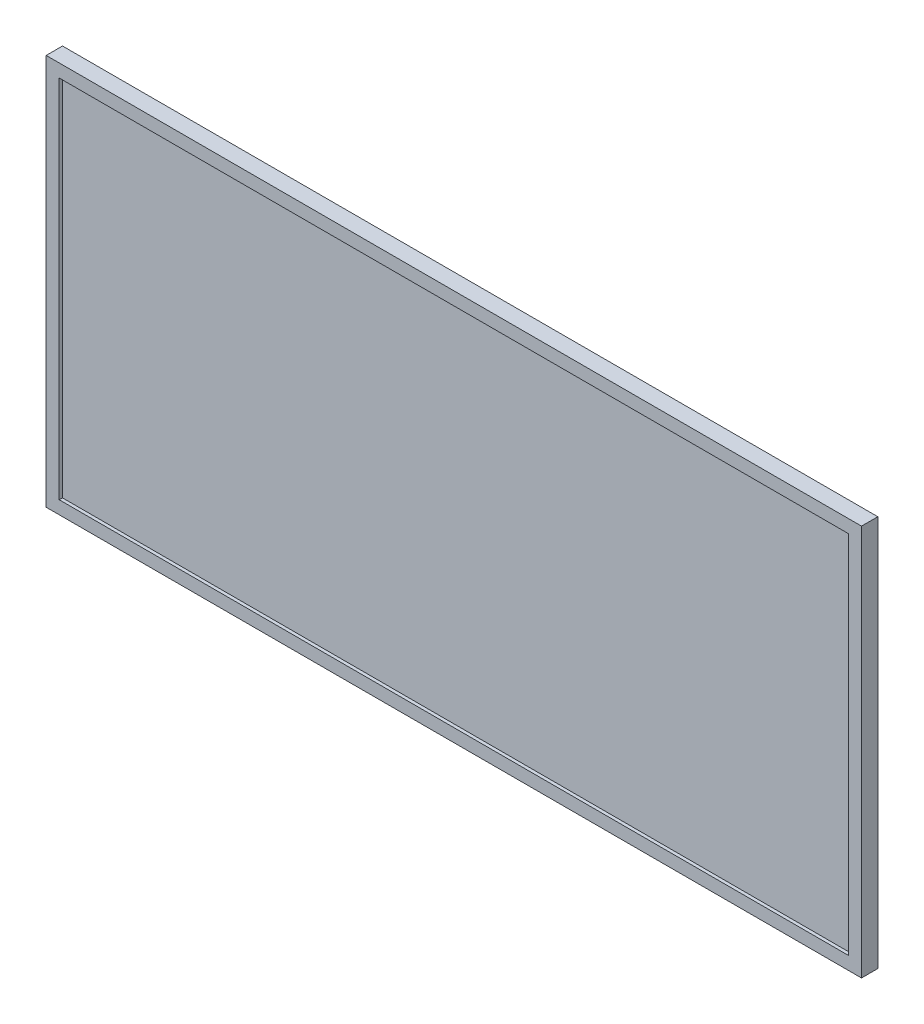
ISO-10303-21;
HEADER;
FILE_DESCRIPTION(('STEP AP214'),'2;1');
FILE_NAME('part.step','',(''),(''),'','','');
FILE_SCHEMA(('AUTOMOTIVE_DESIGN { 1 0 10303 214 1 1 1 1 }'));
ENDSEC;
DATA;
#1=APPLICATION_CONTEXT('core data for automotive mechanical design processes');
#2=APPLICATION_PROTOCOL_DEFINITION('international standard','automotive_design',2000,#1);
#3=PRODUCT_CONTEXT('',#1,'mechanical');
#4=PRODUCT('Part','Part','',(#3));
#5=PRODUCT_RELATED_PRODUCT_CATEGORY('part','',(#4));
#6=PRODUCT_DEFINITION_FORMATION('','',#4);
#7=PRODUCT_DEFINITION_CONTEXT('part definition',#1,'design');
#8=PRODUCT_DEFINITION('design','',#6,#7);
#9=PRODUCT_DEFINITION_SHAPE('','',#8);
#10=(LENGTH_UNIT() NAMED_UNIT(*) SI_UNIT(.MILLI.,.METRE.));
#11=(NAMED_UNIT(*) PLANE_ANGLE_UNIT() SI_UNIT($,.RADIAN.));
#12=(NAMED_UNIT(*) SI_UNIT($,.STERADIAN.) SOLID_ANGLE_UNIT());
#13=UNCERTAINTY_MEASURE_WITH_UNIT(LENGTH_MEASURE(1.E-05),#10,'distance_accuracy_value','');
#14=(GEOMETRIC_REPRESENTATION_CONTEXT(3) GLOBAL_UNCERTAINTY_ASSIGNED_CONTEXT((#13)) GLOBAL_UNIT_ASSIGNED_CONTEXT((#10,
#11,#12)) REPRESENTATION_CONTEXT('',''));
#15=CARTESIAN_POINT('',(0.,0.,0.));
#16=DIRECTION('',(0.,0.,1.));
#17=DIRECTION('',(1.,0.,0.));
#18=AXIS2_PLACEMENT_3D('',#15,#16,#17);
#19=CARTESIAN_POINT('',(0.,0.,0.));
#20=DIRECTION('',(0.,0.,-1.));
#21=DIRECTION('',(-1.,0.,0.));
#22=AXIS2_PLACEMENT_3D('',#19,#20,#21);
#23=PLANE('',#22);
#24=DIRECTION('',(0.,-1.,0.));
#25=VECTOR('',#24,1.);
#26=CARTESIAN_POINT('',(-250.,120.,0.));
#27=LINE('',#26,#25);
#28=CARTESIAN_POINT('',(-250.,120.,0.));
#29=VERTEX_POINT('',#28);
#30=CARTESIAN_POINT('',(-250.,-120.,0.));
#31=VERTEX_POINT('',#30);
#32=EDGE_CURVE('E186',#29,#31,#27,.T.);
#33=ORIENTED_EDGE('',*,*,#32,.F.);
#34=DIRECTION('',(-1.,0.,0.));
#35=VECTOR('',#34,1.);
#36=CARTESIAN_POINT('',(250.,120.,0.));
#37=LINE('',#36,#35);
#38=CARTESIAN_POINT('',(250.,120.,0.));
#39=VERTEX_POINT('',#38);
#40=EDGE_CURVE('E211',#39,#29,#37,.T.);
#41=ORIENTED_EDGE('',*,*,#40,.F.);
#42=DIRECTION('',(0.,1.,0.));
#43=VECTOR('',#42,1.);
#44=CARTESIAN_POINT('',(250.,120.,0.));
#45=LINE('',#44,#43);
#46=CARTESIAN_POINT('',(250.,-120.,0.));
#47=VERTEX_POINT('',#46);
#48=EDGE_CURVE('E222',#47,#39,#45,.T.);
#49=ORIENTED_EDGE('',*,*,#48,.F.);
#50=DIRECTION('',(1.,0.,0.));
#51=VECTOR('',#50,1.);
#52=CARTESIAN_POINT('',(250.,-120.,0.));
#53=LINE('',#52,#51);
#54=EDGE_CURVE('E220',#31,#47,#53,.T.);
#55=ORIENTED_EDGE('',*,*,#54,.F.);
#56=EDGE_LOOP('',(#33,#41,#49,#55));
#57=FACE_BOUND('',#56,.T.);
#58=DIRECTION('',(0.,1.,0.));
#59=VECTOR('',#58,1.);
#60=CARTESIAN_POINT('',(-40.,-30.,0.));
#61=LINE('',#60,#59);
#62=CARTESIAN_POINT('',(-40.,-30.,0.));
#63=VERTEX_POINT('',#62);
#64=CARTESIAN_POINT('',(-40.,30.,0.));
#65=VERTEX_POINT('',#64);
#66=EDGE_CURVE('E349',#63,#65,#61,.T.);
#67=ORIENTED_EDGE('',*,*,#66,.F.);
#68=CARTESIAN_POINT('',(-30.,-30.,0.));
#69=DIRECTION('',(0.,0.,-1.));
#70=DIRECTION('',(-1.,0.,0.));
#71=AXIS2_PLACEMENT_3D('',#68,#69,#70);
#72=CIRCLE('',#71,10.);
#73=CARTESIAN_POINT('',(-30.,-40.,0.));
#74=VERTEX_POINT('',#73);
#75=EDGE_CURVE('E172',#74,#63,#72,.T.);
#76=ORIENTED_EDGE('',*,*,#75,.F.);
#77=DIRECTION('',(-1.,0.,0.));
#78=VECTOR('',#77,1.);
#79=CARTESIAN_POINT('',(30.,-40.,0.));
#80=LINE('',#79,#78);
#81=CARTESIAN_POINT('',(30.,-40.,0.));
#82=VERTEX_POINT('',#81);
#83=EDGE_CURVE('E168',#82,#74,#80,.T.);
#84=ORIENTED_EDGE('',*,*,#83,.F.);
#85=CARTESIAN_POINT('',(30.,-30.,0.));
#86=DIRECTION('',(0.,0.,-1.));
#87=DIRECTION('',(1.,0.,0.));
#88=AXIS2_PLACEMENT_3D('',#85,#86,#87);
#89=CIRCLE('',#88,10.);
#90=CARTESIAN_POINT('',(40.,-30.,0.));
#91=VERTEX_POINT('',#90);
#92=EDGE_CURVE('E374',#91,#82,#89,.T.);
#93=ORIENTED_EDGE('',*,*,#92,.F.);
#94=DIRECTION('',(0.,-1.,0.));
#95=VECTOR('',#94,1.);
#96=CARTESIAN_POINT('',(40.,-30.,0.));
#97=LINE('',#96,#95);
#98=CARTESIAN_POINT('',(40.,30.,0.));
#99=VERTEX_POINT('',#98);
#100=EDGE_CURVE('E372',#99,#91,#97,.T.);
#101=ORIENTED_EDGE('',*,*,#100,.F.);
#102=CARTESIAN_POINT('',(30.,30.,0.));
#103=DIRECTION('',(0.,0.,-1.));
#104=DIRECTION('',(1.,0.,0.));
#105=AXIS2_PLACEMENT_3D('',#102,#103,#104);
#106=CIRCLE('',#105,10.);
#107=CARTESIAN_POINT('',(30.,40.,0.));
#108=VERTEX_POINT('',#107);
#109=EDGE_CURVE('E370',#108,#99,#106,.T.);
#110=ORIENTED_EDGE('',*,*,#109,.F.);
#111=DIRECTION('',(1.,0.,0.));
#112=VECTOR('',#111,1.);
#113=CARTESIAN_POINT('',(30.,40.,0.));
#114=LINE('',#113,#112);
#115=CARTESIAN_POINT('',(-30.,40.,0.));
#116=VERTEX_POINT('',#115);
#117=EDGE_CURVE('E368',#116,#108,#114,.T.);
#118=ORIENTED_EDGE('',*,*,#117,.F.);
#119=CARTESIAN_POINT('',(-30.,30.,0.));
#120=DIRECTION('',(0.,0.,-1.));
#121=DIRECTION('',(1.,0.,0.));
#122=AXIS2_PLACEMENT_3D('',#119,#120,#121);
#123=CIRCLE('',#122,10.);
#124=EDGE_CURVE('E366',#65,#116,#123,.T.);
#125=ORIENTED_EDGE('',*,*,#124,.F.);
#126=EDGE_LOOP('',(#67,#76,#84,#93,#101,#110,#118,#125));
#127=FACE_BOUND('',#126,.T.);
#128=ADVANCED_FACE('F35',(#57,#127),#23,.T.);
#129=CARTESIAN_POINT('',(0.,0.,10.));
#130=DIRECTION('',(0.,0.,-1.));
#131=DIRECTION('',(-1.,0.,0.));
#132=AXIS2_PLACEMENT_3D('',#129,#130,#131);
#133=PLANE('',#132);
#134=DIRECTION('',(0.,-1.,0.));
#135=VECTOR('',#134,1.);
#136=CARTESIAN_POINT('',(-250.,120.,10.));
#137=LINE('',#136,#135);
#138=CARTESIAN_POINT('',(-250.,120.,10.));
#139=VERTEX_POINT('',#138);
#140=CARTESIAN_POINT('',(-250.,-120.,10.));
#141=VERTEX_POINT('',#140);
#142=EDGE_CURVE('E207',#139,#141,#137,.T.);
#143=ORIENTED_EDGE('',*,*,#142,.T.);
#144=DIRECTION('',(1.,0.,0.));
#145=VECTOR('',#144,1.);
#146=CARTESIAN_POINT('',(250.,-120.,10.));
#147=LINE('',#146,#145);
#148=CARTESIAN_POINT('',(250.,-120.,10.));
#149=VERTEX_POINT('',#148);
#150=EDGE_CURVE('E210',#141,#149,#147,.T.);
#151=ORIENTED_EDGE('',*,*,#150,.T.);
#152=DIRECTION('',(0.,1.,0.));
#153=VECTOR('',#152,1.);
#154=CARTESIAN_POINT('',(250.,120.,10.));
#155=LINE('',#154,#153);
#156=CARTESIAN_POINT('',(250.,120.,10.));
#157=VERTEX_POINT('',#156);
#158=EDGE_CURVE('E213',#149,#157,#155,.T.);
#159=ORIENTED_EDGE('',*,*,#158,.T.);
#160=DIRECTION('',(-1.,0.,0.));
#161=VECTOR('',#160,1.);
#162=CARTESIAN_POINT('',(250.,120.,10.));
#163=LINE('',#162,#161);
#164=EDGE_CURVE('E215',#157,#139,#163,.T.);
#165=ORIENTED_EDGE('',*,*,#164,.T.);
#166=EDGE_LOOP('',(#143,#151,#159,#165));
#167=FACE_BOUND('',#166,.T.);
#168=DIRECTION('',(0.,-1.,0.));
#169=VECTOR('',#168,1.);
#170=CARTESIAN_POINT('',(-242.,0.,10.));
#171=LINE('',#170,#169);
#172=CARTESIAN_POINT('',(-242.,112.,10.));
#173=VERTEX_POINT('',#172);
#174=CARTESIAN_POINT('',(-242.,-112.,10.));
#175=VERTEX_POINT('',#174);
#176=EDGE_CURVE('E200',#173,#175,#171,.T.);
#177=ORIENTED_EDGE('',*,*,#176,.F.);
#178=DIRECTION('',(-1.,0.,0.));
#179=VECTOR('',#178,1.);
#180=CARTESIAN_POINT('',(0.,112.,10.));
#181=LINE('',#180,#179);
#182=CARTESIAN_POINT('',(242.,112.,10.));
#183=VERTEX_POINT('',#182);
#184=EDGE_CURVE('E191',#183,#173,#181,.T.);
#185=ORIENTED_EDGE('',*,*,#184,.F.);
#186=DIRECTION('',(0.,1.,0.));
#187=VECTOR('',#186,1.);
#188=CARTESIAN_POINT('',(242.,0.,10.));
#189=LINE('',#188,#187);
#190=CARTESIAN_POINT('',(242.,-112.,10.));
#191=VERTEX_POINT('',#190);
#192=EDGE_CURVE('E204',#191,#183,#189,.T.);
#193=ORIENTED_EDGE('',*,*,#192,.F.);
#194=DIRECTION('',(1.,0.,0.));
#195=VECTOR('',#194,1.);
#196=CARTESIAN_POINT('',(0.,-112.,10.));
#197=LINE('',#196,#195);
#198=EDGE_CURVE('E202',#175,#191,#197,.T.);
#199=ORIENTED_EDGE('',*,*,#198,.F.);
#200=EDGE_LOOP('',(#177,#185,#193,#199));
#201=FACE_BOUND('',#200,.T.);
#202=ADVANCED_FACE('F249',(#167,#201),#133,.F.);
#203=CARTESIAN_POINT('',(-250.,120.,10.));
#204=DIRECTION('',(1.,0.,0.));
#205=DIRECTION('',(0.,1.,0.));
#206=AXIS2_PLACEMENT_3D('',#203,#204,#205);
#207=PLANE('',#206);
#208=ORIENTED_EDGE('',*,*,#32,.T.);
#209=DIRECTION('',(0.,0.,-1.));
#210=VECTOR('',#209,1.);
#211=CARTESIAN_POINT('',(-250.,-120.,10.));
#212=LINE('',#211,#210);
#213=EDGE_CURVE('E11',#141,#31,#212,.T.);
#214=ORIENTED_EDGE('',*,*,#213,.F.);
#215=ORIENTED_EDGE('',*,*,#142,.F.);
#216=DIRECTION('',(0.,0.,-1.));
#217=VECTOR('',#216,1.);
#218=CARTESIAN_POINT('',(-250.,120.,10.));
#219=LINE('',#218,#217);
#220=EDGE_CURVE('E217',#139,#29,#219,.T.);
#221=ORIENTED_EDGE('',*,*,#220,.T.);
#222=EDGE_LOOP('',(#208,#214,#215,#221));
#223=FACE_BOUND('',#222,.T.);
#224=ADVANCED_FACE('F37',(#223),#207,.F.);
#225=CARTESIAN_POINT('',(250.,-120.,10.));
#226=DIRECTION('',(0.,1.,0.));
#227=DIRECTION('',(-1.,0.,0.));
#228=AXIS2_PLACEMENT_3D('',#225,#226,#227);
#229=PLANE('',#228);
#230=ORIENTED_EDGE('',*,*,#54,.T.);
#231=DIRECTION('',(0.,0.,-1.));
#232=VECTOR('',#231,1.);
#233=CARTESIAN_POINT('',(250.,-120.,10.));
#234=LINE('',#233,#232);
#235=EDGE_CURVE('E43',#149,#47,#234,.T.);
#236=ORIENTED_EDGE('',*,*,#235,.F.);
#237=ORIENTED_EDGE('',*,*,#150,.F.);
#238=ORIENTED_EDGE('',*,*,#213,.T.);
#239=EDGE_LOOP('',(#230,#236,#237,#238));
#240=FACE_BOUND('',#239,.T.);
#241=ADVANCED_FACE('F251',(#240),#229,.F.);
#242=CARTESIAN_POINT('',(250.,120.,10.));
#243=DIRECTION('',(-1.,0.,0.));
#244=DIRECTION('',(0.,-1.,0.));
#245=AXIS2_PLACEMENT_3D('',#242,#243,#244);
#246=PLANE('',#245);
#247=ORIENTED_EDGE('',*,*,#48,.T.);
#248=DIRECTION('',(0.,0.,-1.));
#249=VECTOR('',#248,1.);
#250=CARTESIAN_POINT('',(250.,120.,10.));
#251=LINE('',#250,#249);
#252=EDGE_CURVE('E227',#157,#39,#251,.T.);
#253=ORIENTED_EDGE('',*,*,#252,.F.);
#254=ORIENTED_EDGE('',*,*,#158,.F.);
#255=ORIENTED_EDGE('',*,*,#235,.T.);
#256=EDGE_LOOP('',(#247,#253,#254,#255));
#257=FACE_BOUND('',#256,.T.);
#258=ADVANCED_FACE('F234',(#257),#246,.F.);
#259=CARTESIAN_POINT('',(250.,120.,10.));
#260=DIRECTION('',(0.,-1.,0.));
#261=DIRECTION('',(1.,0.,0.));
#262=AXIS2_PLACEMENT_3D('',#259,#260,#261);
#263=PLANE('',#262);
#264=ORIENTED_EDGE('',*,*,#40,.T.);
#265=ORIENTED_EDGE('',*,*,#220,.F.);
#266=ORIENTED_EDGE('',*,*,#164,.F.);
#267=ORIENTED_EDGE('',*,*,#252,.T.);
#268=EDGE_LOOP('',(#264,#265,#266,#267));
#269=FACE_BOUND('',#268,.T.);
#270=ADVANCED_FACE('F243',(#269),#263,.F.);
#271=CARTESIAN_POINT('',(-242.,120.,10.));
#272=DIRECTION('',(1.,0.,0.));
#273=DIRECTION('',(0.,1.,0.));
#274=AXIS2_PLACEMENT_3D('',#271,#272,#273);
#275=PLANE('',#274);
#276=DIRECTION('',(0.,-1.,0.));
#277=VECTOR('',#276,1.);
#278=CARTESIAN_POINT('',(-242.,0.,8.));
#279=LINE('',#278,#277);
#280=CARTESIAN_POINT('',(-242.,112.,8.));
#281=VERTEX_POINT('',#280);
#282=CARTESIAN_POINT('',(-242.,-112.,8.));
#283=VERTEX_POINT('',#282);
#284=EDGE_CURVE('E174',#281,#283,#279,.T.);
#285=ORIENTED_EDGE('',*,*,#284,.F.);
#286=DIRECTION('',(0.,0.,-1.));
#287=VECTOR('',#286,1.);
#288=CARTESIAN_POINT('',(-242.,112.,10.));
#289=LINE('',#288,#287);
#290=EDGE_CURVE('E188',#173,#281,#289,.T.);
#291=ORIENTED_EDGE('',*,*,#290,.F.);
#292=ORIENTED_EDGE('',*,*,#176,.T.);
#293=DIRECTION('',(0.,0.,-1.));
#294=VECTOR('',#293,1.);
#295=CARTESIAN_POINT('',(-242.,-112.,10.));
#296=LINE('',#295,#294);
#297=EDGE_CURVE('E183',#175,#283,#296,.T.);
#298=ORIENTED_EDGE('',*,*,#297,.T.);
#299=EDGE_LOOP('',(#285,#291,#292,#298));
#300=FACE_BOUND('',#299,.T.);
#301=ADVANCED_FACE('F267',(#300),#275,.T.);
#302=CARTESIAN_POINT('',(250.,-112.,10.));
#303=DIRECTION('',(0.,1.,0.));
#304=DIRECTION('',(-1.,0.,0.));
#305=AXIS2_PLACEMENT_3D('',#302,#303,#304);
#306=PLANE('',#305);
#307=DIRECTION('',(1.,0.,0.));
#308=VECTOR('',#307,1.);
#309=CARTESIAN_POINT('',(0.,-112.,8.));
#310=LINE('',#309,#308);
#311=CARTESIAN_POINT('',(242.,-112.,8.));
#312=VERTEX_POINT('',#311);
#313=EDGE_CURVE('E177',#283,#312,#310,.T.);
#314=ORIENTED_EDGE('',*,*,#313,.F.);
#315=ORIENTED_EDGE('',*,*,#297,.F.);
#316=ORIENTED_EDGE('',*,*,#198,.T.);
#317=DIRECTION('',(0.,0.,-1.));
#318=VECTOR('',#317,1.);
#319=CARTESIAN_POINT('',(242.,-112.,10.));
#320=LINE('',#319,#318);
#321=EDGE_CURVE('E187',#191,#312,#320,.T.);
#322=ORIENTED_EDGE('',*,*,#321,.T.);
#323=EDGE_LOOP('',(#314,#315,#316,#322));
#324=FACE_BOUND('',#323,.T.);
#325=ADVANCED_FACE('F271',(#324),#306,.T.);
#326=CARTESIAN_POINT('',(242.,120.,10.));
#327=DIRECTION('',(-1.,0.,0.));
#328=DIRECTION('',(0.,-1.,0.));
#329=AXIS2_PLACEMENT_3D('',#326,#327,#328);
#330=PLANE('',#329);
#331=DIRECTION('',(0.,1.,0.));
#332=VECTOR('',#331,1.);
#333=CARTESIAN_POINT('',(242.,0.,8.));
#334=LINE('',#333,#332);
#335=CARTESIAN_POINT('',(242.,112.,8.));
#336=VERTEX_POINT('',#335);
#337=EDGE_CURVE('E193',#312,#336,#334,.T.);
#338=ORIENTED_EDGE('',*,*,#337,.F.);
#339=ORIENTED_EDGE('',*,*,#321,.F.);
#340=ORIENTED_EDGE('',*,*,#192,.T.);
#341=DIRECTION('',(0.,0.,-1.));
#342=VECTOR('',#341,1.);
#343=CARTESIAN_POINT('',(242.,112.,10.));
#344=LINE('',#343,#342);
#345=EDGE_CURVE('E58',#183,#336,#344,.T.);
#346=ORIENTED_EDGE('',*,*,#345,.T.);
#347=EDGE_LOOP('',(#338,#339,#340,#346));
#348=FACE_BOUND('',#347,.T.);
#349=ADVANCED_FACE('F277',(#348),#330,.T.);
#350=CARTESIAN_POINT('',(250.,112.,10.));
#351=DIRECTION('',(0.,-1.,0.));
#352=DIRECTION('',(1.,0.,0.));
#353=AXIS2_PLACEMENT_3D('',#350,#351,#352);
#354=PLANE('',#353);
#355=DIRECTION('',(-1.,0.,0.));
#356=VECTOR('',#355,1.);
#357=CARTESIAN_POINT('',(0.,112.,8.));
#358=LINE('',#357,#356);
#359=EDGE_CURVE('E197',#336,#281,#358,.T.);
#360=ORIENTED_EDGE('',*,*,#359,.F.);
#361=ORIENTED_EDGE('',*,*,#345,.F.);
#362=ORIENTED_EDGE('',*,*,#184,.T.);
#363=ORIENTED_EDGE('',*,*,#290,.T.);
#364=EDGE_LOOP('',(#360,#361,#362,#363));
#365=FACE_BOUND('',#364,.T.);
#366=ADVANCED_FACE('F286',(#365),#354,.T.);
#367=CARTESIAN_POINT('',(0.,0.,8.));
#368=DIRECTION('',(0.,0.,-1.));
#369=DIRECTION('',(-1.,0.,0.));
#370=AXIS2_PLACEMENT_3D('',#367,#368,#369);
#371=PLANE('',#370);
#372=ORIENTED_EDGE('',*,*,#284,.T.);
#373=ORIENTED_EDGE('',*,*,#313,.T.);
#374=ORIENTED_EDGE('',*,*,#337,.T.);
#375=ORIENTED_EDGE('',*,*,#359,.T.);
#376=EDGE_LOOP('',(#372,#373,#374,#375));
#377=FACE_BOUND('',#376,.T.);
#378=ADVANCED_FACE('F289',(#377),#371,.F.);
#379=CARTESIAN_POINT('',(-30.,-30.,-20.));
#380=DIRECTION('',(0.,0.,1.));
#381=DIRECTION('',(1.,0.,0.));
#382=AXIS2_PLACEMENT_3D('',#379,#380,#381);
#383=CYLINDRICAL_SURFACE('',#382,10.);
#384=ORIENTED_EDGE('',*,*,#75,.T.);
#385=DIRECTION('',(0.,0.,1.));
#386=VECTOR('',#385,1.);
#387=CARTESIAN_POINT('',(-40.,-30.,-20.));
#388=LINE('',#387,#386);
#389=CARTESIAN_POINT('',(-40.,-30.,-20.));
#390=VERTEX_POINT('',#389);
#391=EDGE_CURVE('E153',#390,#63,#388,.T.);
#392=ORIENTED_EDGE('',*,*,#391,.F.);
#393=CARTESIAN_POINT('',(-30.,-30.,-20.));
#394=DIRECTION('',(0.,0.,-1.));
#395=DIRECTION('',(-1.,0.,0.));
#396=AXIS2_PLACEMENT_3D('',#393,#394,#395);
#397=CIRCLE('',#396,10.);
#398=CARTESIAN_POINT('',(-30.,-40.,-20.));
#399=VERTEX_POINT('',#398);
#400=EDGE_CURVE('E160',#399,#390,#397,.T.);
#401=ORIENTED_EDGE('',*,*,#400,.F.);
#402=DIRECTION('',(0.,0.,1.));
#403=VECTOR('',#402,1.);
#404=CARTESIAN_POINT('',(-30.,-40.,-20.));
#405=LINE('',#404,#403);
#406=EDGE_CURVE('E363',#399,#74,#405,.T.);
#407=ORIENTED_EDGE('',*,*,#406,.T.);
#408=EDGE_LOOP('',(#384,#392,#401,#407));
#409=FACE_BOUND('',#408,.T.);
#410=ADVANCED_FACE('F170',(#409),#383,.T.);
#411=CARTESIAN_POINT('',(-40.,-30.,-20.));
#412=DIRECTION('',(1.,0.,0.));
#413=DIRECTION('',(0.,0.,-1.));
#414=AXIS2_PLACEMENT_3D('',#411,#412,#413);
#415=PLANE('',#414);
#416=ORIENTED_EDGE('',*,*,#66,.T.);
#417=DIRECTION('',(0.,0.,1.));
#418=VECTOR('',#417,1.);
#419=CARTESIAN_POINT('',(-40.,30.,-20.));
#420=LINE('',#419,#418);
#421=CARTESIAN_POINT('',(-40.,30.,-20.));
#422=VERTEX_POINT('',#421);
#423=EDGE_CURVE('E156',#422,#65,#420,.T.);
#424=ORIENTED_EDGE('',*,*,#423,.F.);
#425=DIRECTION('',(0.,1.,0.));
#426=VECTOR('',#425,1.);
#427=CARTESIAN_POINT('',(-40.,-30.,-20.));
#428=LINE('',#427,#426);
#429=EDGE_CURVE('E149',#390,#422,#428,.T.);
#430=ORIENTED_EDGE('',*,*,#429,.F.);
#431=ORIENTED_EDGE('',*,*,#391,.T.);
#432=EDGE_LOOP('',(#416,#424,#430,#431));
#433=FACE_BOUND('',#432,.T.);
#434=ADVANCED_FACE('F151',(#433),#415,.F.);
#435=CARTESIAN_POINT('',(-30.,30.,-20.));
#436=DIRECTION('',(0.,0.,1.));
#437=DIRECTION('',(1.,0.,0.));
#438=AXIS2_PLACEMENT_3D('',#435,#436,#437);
#439=CYLINDRICAL_SURFACE('',#438,10.);
#440=ORIENTED_EDGE('',*,*,#124,.T.);
#441=DIRECTION('',(0.,0.,1.));
#442=VECTOR('',#441,1.);
#443=CARTESIAN_POINT('',(-30.,40.,-20.));
#444=LINE('',#443,#442);
#445=CARTESIAN_POINT('',(-30.,40.,-20.));
#446=VERTEX_POINT('',#445);
#447=EDGE_CURVE('E179',#446,#116,#444,.T.);
#448=ORIENTED_EDGE('',*,*,#447,.F.);
#449=CARTESIAN_POINT('',(-30.,30.,-20.));
#450=DIRECTION('',(0.,0.,-1.));
#451=DIRECTION('',(1.,0.,0.));
#452=AXIS2_PLACEMENT_3D('',#449,#450,#451);
#453=CIRCLE('',#452,10.);
#454=EDGE_CURVE('E159',#422,#446,#453,.T.);
#455=ORIENTED_EDGE('',*,*,#454,.F.);
#456=ORIENTED_EDGE('',*,*,#423,.T.);
#457=EDGE_LOOP('',(#440,#448,#455,#456));
#458=FACE_BOUND('',#457,.T.);
#459=ADVANCED_FACE('F306',(#458),#439,.T.);
#460=CARTESIAN_POINT('',(30.,40.,-20.));
#461=DIRECTION('',(0.,-1.,0.));
#462=DIRECTION('',(0.,0.,-1.));
#463=AXIS2_PLACEMENT_3D('',#460,#461,#462);
#464=PLANE('',#463);
#465=ORIENTED_EDGE('',*,*,#117,.T.);
#466=DIRECTION('',(0.,0.,1.));
#467=VECTOR('',#466,1.);
#468=CARTESIAN_POINT('',(30.,40.,-20.));
#469=LINE('',#468,#467);
#470=CARTESIAN_POINT('',(30.,40.,-20.));
#471=VERTEX_POINT('',#470);
#472=EDGE_CURVE('E385',#471,#108,#469,.T.);
#473=ORIENTED_EDGE('',*,*,#472,.F.);
#474=DIRECTION('',(1.,0.,0.));
#475=VECTOR('',#474,1.);
#476=CARTESIAN_POINT('',(30.,40.,-20.));
#477=LINE('',#476,#475);
#478=EDGE_CURVE('E355',#446,#471,#477,.T.);
#479=ORIENTED_EDGE('',*,*,#478,.F.);
#480=ORIENTED_EDGE('',*,*,#447,.T.);
#481=EDGE_LOOP('',(#465,#473,#479,#480));
#482=FACE_BOUND('',#481,.T.);
#483=ADVANCED_FACE('F310',(#482),#464,.F.);
#484=CARTESIAN_POINT('',(30.,30.,-20.));
#485=DIRECTION('',(0.,0.,1.));
#486=DIRECTION('',(1.,0.,0.));
#487=AXIS2_PLACEMENT_3D('',#484,#485,#486);
#488=CYLINDRICAL_SURFACE('',#487,10.);
#489=ORIENTED_EDGE('',*,*,#109,.T.);
#490=DIRECTION('',(0.,0.,1.));
#491=VECTOR('',#490,1.);
#492=CARTESIAN_POINT('',(40.,30.,-20.));
#493=LINE('',#492,#491);
#494=CARTESIAN_POINT('',(40.,30.,-20.));
#495=VERTEX_POINT('',#494);
#496=EDGE_CURVE('E382',#495,#99,#493,.T.);
#497=ORIENTED_EDGE('',*,*,#496,.F.);
#498=CARTESIAN_POINT('',(30.,30.,-20.));
#499=DIRECTION('',(0.,0.,-1.));
#500=DIRECTION('',(1.,0.,0.));
#501=AXIS2_PLACEMENT_3D('',#498,#499,#500);
#502=CIRCLE('',#501,10.);
#503=EDGE_CURVE('E357',#471,#495,#502,.T.);
#504=ORIENTED_EDGE('',*,*,#503,.F.);
#505=ORIENTED_EDGE('',*,*,#472,.T.);
#506=EDGE_LOOP('',(#489,#497,#504,#505));
#507=FACE_BOUND('',#506,.T.);
#508=ADVANCED_FACE('F316',(#507),#488,.T.);
#509=CARTESIAN_POINT('',(40.,-30.,-20.));
#510=DIRECTION('',(-1.,0.,0.));
#511=DIRECTION('',(0.,0.,1.));
#512=AXIS2_PLACEMENT_3D('',#509,#510,#511);
#513=PLANE('',#512);
#514=ORIENTED_EDGE('',*,*,#100,.T.);
#515=DIRECTION('',(0.,0.,1.));
#516=VECTOR('',#515,1.);
#517=CARTESIAN_POINT('',(40.,-30.,-20.));
#518=LINE('',#517,#516);
#519=CARTESIAN_POINT('',(40.,-30.,-20.));
#520=VERTEX_POINT('',#519);
#521=EDGE_CURVE('E379',#520,#91,#518,.T.);
#522=ORIENTED_EDGE('',*,*,#521,.F.);
#523=DIRECTION('',(0.,-1.,0.));
#524=VECTOR('',#523,1.);
#525=CARTESIAN_POINT('',(40.,-30.,-20.));
#526=LINE('',#525,#524);
#527=EDGE_CURVE('E359',#495,#520,#526,.T.);
#528=ORIENTED_EDGE('',*,*,#527,.F.);
#529=ORIENTED_EDGE('',*,*,#496,.T.);
#530=EDGE_LOOP('',(#514,#522,#528,#529));
#531=FACE_BOUND('',#530,.T.);
#532=ADVANCED_FACE('F320',(#531),#513,.F.);
#533=CARTESIAN_POINT('',(30.,-30.,-20.));
#534=DIRECTION('',(0.,0.,1.));
#535=DIRECTION('',(1.,0.,0.));
#536=AXIS2_PLACEMENT_3D('',#533,#534,#535);
#537=CYLINDRICAL_SURFACE('',#536,10.);
#538=ORIENTED_EDGE('',*,*,#92,.T.);
#539=DIRECTION('',(0.,0.,1.));
#540=VECTOR('',#539,1.);
#541=CARTESIAN_POINT('',(30.,-40.,-20.));
#542=LINE('',#541,#540);
#543=CARTESIAN_POINT('',(30.,-40.,-20.));
#544=VERTEX_POINT('',#543);
#545=EDGE_CURVE('E50',#544,#82,#542,.T.);
#546=ORIENTED_EDGE('',*,*,#545,.F.);
#547=CARTESIAN_POINT('',(30.,-30.,-20.));
#548=DIRECTION('',(0.,0.,-1.));
#549=DIRECTION('',(1.,0.,0.));
#550=AXIS2_PLACEMENT_3D('',#547,#548,#549);
#551=CIRCLE('',#550,10.);
#552=EDGE_CURVE('E361',#520,#544,#551,.T.);
#553=ORIENTED_EDGE('',*,*,#552,.F.);
#554=ORIENTED_EDGE('',*,*,#521,.T.);
#555=EDGE_LOOP('',(#538,#546,#553,#554));
#556=FACE_BOUND('',#555,.T.);
#557=ADVANCED_FACE('F324',(#556),#537,.T.);
#558=CARTESIAN_POINT('',(30.,-40.,-20.));
#559=DIRECTION('',(0.,1.,0.));
#560=DIRECTION('',(0.,0.,1.));
#561=AXIS2_PLACEMENT_3D('',#558,#559,#560);
#562=PLANE('',#561);
#563=ORIENTED_EDGE('',*,*,#83,.T.);
#564=ORIENTED_EDGE('',*,*,#406,.F.);
#565=DIRECTION('',(-1.,0.,0.));
#566=VECTOR('',#565,1.);
#567=CARTESIAN_POINT('',(30.,-40.,-20.));
#568=LINE('',#567,#566);
#569=EDGE_CURVE('E164',#544,#399,#568,.T.);
#570=ORIENTED_EDGE('',*,*,#569,.F.);
#571=ORIENTED_EDGE('',*,*,#545,.T.);
#572=EDGE_LOOP('',(#563,#564,#570,#571));
#573=FACE_BOUND('',#572,.T.);
#574=ADVANCED_FACE('F328',(#573),#562,.F.);
#575=CARTESIAN_POINT('',(-30.,-30.,-20.));
#576=DIRECTION('',(0.,0.,-1.));
#577=DIRECTION('',(-1.,0.,0.));
#578=AXIS2_PLACEMENT_3D('',#575,#576,#577);
#579=PLANE('',#578);
#580=CARTESIAN_POINT('',(0.,0.,-20.));
#581=DIRECTION('',(0.,0.,-1.));
#582=DIRECTION('',(-1.,0.,0.));
#583=AXIS2_PLACEMENT_3D('',#580,#581,#582);
#584=CIRCLE('',#583,1.65);
#585=CARTESIAN_POINT('',(-1.65,0.,-20.));
#586=VERTEX_POINT('',#585);
#587=EDGE_CURVE('E347',#586,#586,#584,.T.);
#588=ORIENTED_EDGE('',*,*,#587,.F.);
#589=EDGE_LOOP('',(#588));
#590=FACE_BOUND('',#589,.T.);
#591=ORIENTED_EDGE('',*,*,#400,.T.);
#592=ORIENTED_EDGE('',*,*,#429,.T.);
#593=ORIENTED_EDGE('',*,*,#454,.T.);
#594=ORIENTED_EDGE('',*,*,#478,.T.);
#595=ORIENTED_EDGE('',*,*,#503,.T.);
#596=ORIENTED_EDGE('',*,*,#527,.T.);
#597=ORIENTED_EDGE('',*,*,#552,.T.);
#598=ORIENTED_EDGE('',*,*,#569,.T.);
#599=EDGE_LOOP('',(#591,#592,#593,#594,#595,#596,#597,#598));
#600=FACE_BOUND('',#599,.T.);
#601=ADVANCED_FACE('F163',(#590,#600),#579,.T.);
#602=CARTESIAN_POINT('',(0.,0.,-10.));
#603=DIRECTION('',(0.,0.,-1.));
#604=DIRECTION('',(-1.,0.,0.));
#605=AXIS2_PLACEMENT_3D('',#602,#603,#604);
#606=CYLINDRICAL_SURFACE('',#605,1.65);
#607=CARTESIAN_POINT('',(0.,0.,-10.));
#608=DIRECTION('',(0.,0.,-1.));
#609=DIRECTION('',(-1.,0.,0.));
#610=AXIS2_PLACEMENT_3D('',#607,#608,#609);
#611=CIRCLE('',#610,1.65);
#612=CARTESIAN_POINT('',(-1.65,0.,-10.));
#613=VERTEX_POINT('',#612);
#614=EDGE_CURVE('E346',#613,#613,#611,.T.);
#615=ORIENTED_EDGE('',*,*,#614,.F.);
#616=EDGE_LOOP('',(#615));
#617=FACE_BOUND('',#616,.T.);
#618=ORIENTED_EDGE('',*,*,#587,.T.);
#619=EDGE_LOOP('',(#618));
#620=FACE_BOUND('',#619,.T.);
#621=ADVANCED_FACE('F334',(#617,#620),#606,.F.);
#622=CARTESIAN_POINT('',(0.,0.,-10.));
#623=DIRECTION('',(0.,0.,-1.));
#624=DIRECTION('',(-1.,0.,0.));
#625=AXIS2_PLACEMENT_3D('',#622,#623,#624);
#626=PLANE('',#625);
#627=ORIENTED_EDGE('',*,*,#614,.T.);
#628=EDGE_LOOP('',(#627));
#629=FACE_BOUND('',#628,.T.);
#630=ADVANCED_FACE('F338',(#629),#626,.T.);
#631=CLOSED_SHELL('',(#128,#202,#224,#241,#258,#270,#301,#325,#349,#366,#378,#410,#434,#459,
#483,#508,#532,#557,#574,#601,#621,#630));
#632=MANIFOLD_SOLID_BREP('B2',#631);
#633=ADVANCED_BREP_SHAPE_REPRESENTATION('',(#18,#632),#14);
#634=SHAPE_DEFINITION_REPRESENTATION(#9,#633);
ENDSEC;
END-ISO-10303-21;
